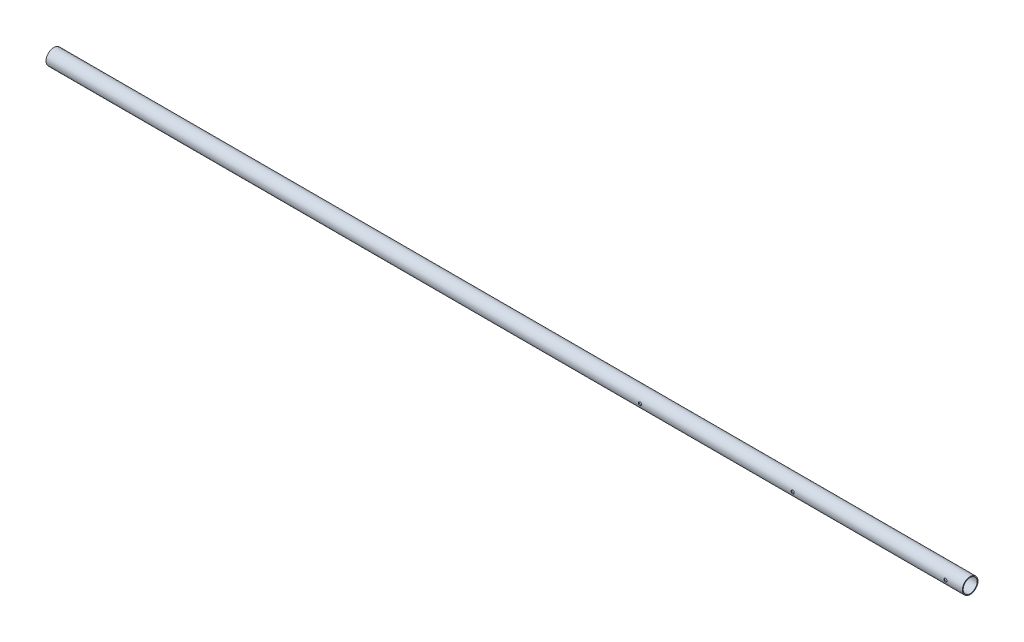
ISO-10303-21;
HEADER;
FILE_DESCRIPTION(('STEP AP214'),'2;1');
FILE_NAME('part.step','',(''),(''),'','','');
FILE_SCHEMA(('AUTOMOTIVE_DESIGN { 1 0 10303 214 1 1 1 1 }'));
ENDSEC;
DATA;
#1=APPLICATION_CONTEXT('core data for automotive mechanical design processes');
#2=APPLICATION_PROTOCOL_DEFINITION('international standard','automotive_design',2000,#1);
#3=PRODUCT_CONTEXT('',#1,'mechanical');
#4=PRODUCT('Part','Part','',(#3));
#5=PRODUCT_RELATED_PRODUCT_CATEGORY('part','',(#4));
#6=PRODUCT_DEFINITION_FORMATION('','',#4);
#7=PRODUCT_DEFINITION_CONTEXT('part definition',#1,'design');
#8=PRODUCT_DEFINITION('design','',#6,#7);
#9=PRODUCT_DEFINITION_SHAPE('','',#8);
#10=(LENGTH_UNIT() NAMED_UNIT(*) SI_UNIT(.MILLI.,.METRE.));
#11=(NAMED_UNIT(*) PLANE_ANGLE_UNIT() SI_UNIT($,.RADIAN.));
#12=(NAMED_UNIT(*) SI_UNIT($,.STERADIAN.) SOLID_ANGLE_UNIT());
#13=UNCERTAINTY_MEASURE_WITH_UNIT(LENGTH_MEASURE(1.E-05),#10,'distance_accuracy_value','');
#14=(GEOMETRIC_REPRESENTATION_CONTEXT(3) GLOBAL_UNCERTAINTY_ASSIGNED_CONTEXT((#13)) GLOBAL_UNIT_ASSIGNED_CONTEXT((#10,
#11,#12)) REPRESENTATION_CONTEXT('',''));
#15=CARTESIAN_POINT('',(0.,0.,0.));
#16=DIRECTION('',(0.,0.,1.));
#17=DIRECTION('',(1.,0.,0.));
#18=AXIS2_PLACEMENT_3D('',#15,#16,#17);
#19=CARTESIAN_POINT('',(1346.2,0.,0.));
#20=DIRECTION('',(0.,0.,1.));
#21=DIRECTION('',(1.,0.,0.));
#22=AXIS2_PLACEMENT_3D('',#19,#20,#21);
#23=CYLINDRICAL_SURFACE('',#22,2.3876);
#24=CARTESIAN_POINT('',(1343.8124,0.,10.4648));
#25=CARTESIAN_POINT('',(1343.81240657058,0.132130476058959,10.4647964514016));
#26=CARTESIAN_POINT('',(1343.82341617162,0.264420358290094,10.462269601893));
#27=CARTESIAN_POINT('',(1343.86714590616,0.525345225066872,10.4524244369325));
#28=CARTESIAN_POINT('',(1343.8999078953,0.653972663795565,10.4450968843992));
#29=CARTESIAN_POINT('',(1343.98605711521,0.903596989816604,10.426465897886));
#30=CARTESIAN_POINT('',(1344.03941180257,1.02460556826829,10.4151687397336));
#31=CARTESIAN_POINT('',(1344.1651414532,1.25591227924259,10.3898161075362));
#32=CARTESIAN_POINT('',(1344.23751087387,1.36621352003832,10.3757614375804));
#33=CARTESIAN_POINT('',(1344.40056206508,1.57495019781504,10.3461524526149));
#34=CARTESIAN_POINT('',(1344.49151335739,1.67317229092836,10.3305780670015));
#35=CARTESIAN_POINT('',(1344.68857265671,1.85311314339548,10.2998234611443));
#36=CARTESIAN_POINT('',(1344.79468293091,1.93482942970319,10.2846433002633));
#37=CARTESIAN_POINT('',(1345.02063052625,2.08038327019831,10.2561995352339));
#38=CARTESIAN_POINT('',(1345.14061845344,2.14399244864527,10.2429613530362));
#39=CARTESIAN_POINT('',(1345.38993221242,2.25005969360349,10.2201875236951));
#40=CARTESIAN_POINT('',(1345.51925674251,2.29252070204645,10.2106513616026));
#41=CARTESIAN_POINT('',(1345.7812667249,2.3543805931442,10.1965646284168));
#42=CARTESIAN_POINT('',(1345.91385876982,2.37415617862409,10.1919327227922));
#43=CARTESIAN_POINT('',(1346.18055342078,2.39125577964706,10.187934919261));
#44=CARTESIAN_POINT('',(1346.31465582384,2.38858277701799,10.1885683219677));
#45=CARTESIAN_POINT('',(1346.577738235,2.36116353389813,10.19495607049));
#46=CARTESIAN_POINT('',(1346.7067670664,2.33685826485838,10.2006081066181));
#47=CARTESIAN_POINT('',(1346.9588669272,2.26756413482412,10.2162342190724));
#48=CARTESIAN_POINT('',(1347.08193755346,2.2225738764058,10.2262085874015));
#49=CARTESIAN_POINT('',(1347.31985309298,2.11278891738554,10.2494546633016));
#50=CARTESIAN_POINT('',(1347.43461795279,2.04782683973298,10.262754053739));
#51=CARTESIAN_POINT('',(1347.65177152251,1.9000645756494,10.2911338885937));
#52=CARTESIAN_POINT('',(1347.75415927029,1.81726300387501,10.30621447129));
#53=CARTESIAN_POINT('',(1347.94617992629,1.63386805841727,10.3368922317217));
#54=CARTESIAN_POINT('',(1348.03545799324,1.53290344594706,10.352493236861));
#55=CARTESIAN_POINT('',(1348.19591330623,1.31720690355542,10.3821402814243));
#56=CARTESIAN_POINT('',(1348.26708270724,1.20246903835412,10.3961856454301));
#57=CARTESIAN_POINT('',(1348.38939723511,0.961997129098334,10.4211927318742));
#58=CARTESIAN_POINT('',(1348.44047668404,0.836228635777723,10.4321443077834));
#59=CARTESIAN_POINT('',(1348.52057759237,0.577744190266569,10.4496381198318));
#60=CARTESIAN_POINT('',(1348.54964516397,0.445043387745705,10.4561895704206));
#61=CARTESIAN_POINT('',(1348.57403794837,0.259405998113417,10.4617127845025));
#62=CARTESIAN_POINT('',(1348.57911906516,0.207669475492341,10.4628677610205));
#63=CARTESIAN_POINT('',(1348.58590138703,0.103963530060327,10.4644120677081));
#64=CARTESIAN_POINT('',(1348.58760258556,0.0519941067982693,10.464801396394));
#65=CARTESIAN_POINT('',(1348.58759342942,-0.13213047605895,10.4647964514016));
#66=CARTESIAN_POINT('',(1348.57658382838,-0.264420358290086,10.462269601893));
#67=CARTESIAN_POINT('',(1348.53285409384,-0.525345225066867,10.4524244369325));
#68=CARTESIAN_POINT('',(1348.5000921047,-0.653972663795562,10.4450968843992));
#69=CARTESIAN_POINT('',(1348.41394288479,-0.903596989816603,10.426465897886));
#70=CARTESIAN_POINT('',(1348.36058819743,-1.02460556826829,10.4151687397336));
#71=CARTESIAN_POINT('',(1348.2348585468,-1.25591227924258,10.3898161075362));
#72=CARTESIAN_POINT('',(1348.16248912613,-1.36621352003832,10.3757614375804));
#73=CARTESIAN_POINT('',(1347.99943793492,-1.57495019781504,10.3461524526149));
#74=CARTESIAN_POINT('',(1347.90848664261,-1.67317229092836,10.3305780670015));
#75=CARTESIAN_POINT('',(1347.71142734329,-1.85311314339549,10.2998234611443));
#76=CARTESIAN_POINT('',(1347.60531706909,-1.93482942970319,10.2846433002633));
#77=CARTESIAN_POINT('',(1347.37936947375,-2.08038327019831,10.2561995352339));
#78=CARTESIAN_POINT('',(1347.25938154656,-2.14399244864527,10.2429613530362));
#79=CARTESIAN_POINT('',(1347.01006778758,-2.25005969360349,10.2201875236951));
#80=CARTESIAN_POINT('',(1346.88074325748,-2.29252070204645,10.2106513616026));
#81=CARTESIAN_POINT('',(1346.6187332751,-2.3543805931442,10.1965646284168));
#82=CARTESIAN_POINT('',(1346.48614123018,-2.37415617862409,10.1919327227922));
#83=CARTESIAN_POINT('',(1346.21944657922,-2.39125577964706,10.187934919261));
#84=CARTESIAN_POINT('',(1346.08534417616,-2.38858277701799,10.1885683219677));
#85=CARTESIAN_POINT('',(1345.822261765,-2.36116353389813,10.19495607049));
#86=CARTESIAN_POINT('',(1345.6932329336,-2.33685826485837,10.2006081066181));
#87=CARTESIAN_POINT('',(1345.4411330728,-2.26756413482412,10.2162342190724));
#88=CARTESIAN_POINT('',(1345.31806244654,-2.22257387640582,10.2262085874015));
#89=CARTESIAN_POINT('',(1345.08014690702,-2.11278891738551,10.2494546633016));
#90=CARTESIAN_POINT('',(1344.96538204721,-2.04782683973289,10.262754053739));
#91=CARTESIAN_POINT('',(1344.74822847749,-1.9000645756493,10.2911338885937));
#92=CARTESIAN_POINT('',(1344.64584072971,-1.81726300387498,10.30621447129));
#93=CARTESIAN_POINT('',(1344.45382007371,-1.63386805841729,10.3368922317217));
#94=CARTESIAN_POINT('',(1344.36454200676,-1.53290344594706,10.352493236861));
#95=CARTESIAN_POINT('',(1344.20408669377,-1.31720690355541,10.3821402814243));
#96=CARTESIAN_POINT('',(1344.13291729276,-1.20246903835412,10.3961856454301));
#97=CARTESIAN_POINT('',(1344.01060276489,-0.961997129098335,10.4211927318742));
#98=CARTESIAN_POINT('',(1343.95952331596,-0.836228635777724,10.4321443077834));
#99=CARTESIAN_POINT('',(1343.87942240763,-0.577744190266569,10.4496381198318));
#100=CARTESIAN_POINT('',(1343.85035483603,-0.445043387745706,10.4561895704206));
#101=CARTESIAN_POINT('',(1343.82596205163,-0.259405998113415,10.4617127845025));
#102=CARTESIAN_POINT('',(1343.82088093484,-0.207669475492337,10.4628677610205));
#103=CARTESIAN_POINT('',(1343.81409861297,-0.10396353006032,10.4644120677081));
#104=CARTESIAN_POINT('',(1343.81239741444,-0.0519941067982609,10.464801396394));
#105=CARTESIAN_POINT('',(1343.8124,0.,10.4648));
#106=B_SPLINE_CURVE_WITH_KNOTS('',3,(#24,#25,#26,#27,#28,#29,#30,#31,#32,#33,#34,#35,#36,#37,
#38,#39,#40,#41,#42,#43,#44,#45,#46,#47,#48,#49,#50,#51,#52,#53,#54,#55,#56,#57,#58,#59,#60,#61,
#62,#63,#64,#65,#66,#67,#68,#69,#70,#71,#72,#73,#74,#75,#76,#77,#78,#79,#80,#81,#82,#83,#84,#85,
#86,#87,#88,#89,#90,#91,#92,#93,#94,#95,#96,#97,#98,#99,#100,#101,#102,#103,#104,#105),
.UNSPECIFIED.,.T.,.F.,(4,2,2,2,2,2,2,2,2,2,2,2,2,2,2,2,2,2,2,2,2,2,2,2,2,2,2,2,2,2,2,2,2,2,2,2,
2,2,2,2,4),(0.,0.396192335565521,0.79314923653144,1.18948136344149,1.58569809138061,
1.98813187019893,2.39062590055583,2.79799171002007,3.20530083479919,3.60574375712304,
4.00613348977789,4.39854363394344,4.79098029220885,5.18679987270528,5.58265020204462,
5.98777052529931,6.39306605720461,6.79967577915924,7.20543132878516,7.3613350029747,
7.51723897927502,7.91343131484055,8.31038821580647,8.70672034271652,9.10293707065564,
9.50537084947396,9.90786487983086,10.3152306892951,10.7225398140742,11.1229827363981,
11.5233724690529,11.9157826132185,12.3082192714839,12.7040388519804,13.0998891813196,
13.5050095045743,13.9103050364796,14.3169147584343,14.7226703080602,14.8785739822497,
15.0344779585501),.UNSPECIFIED.);
#107=CARTESIAN_POINT('',(1343.8124,0.,10.4648));
#108=VERTEX_POINT('',#107);
#109=EDGE_CURVE('E19',#108,#108,#106,.T.);
#110=ORIENTED_EDGE('',*,*,#109,.T.);
#111=EDGE_LOOP('',(#110));
#112=FACE_BOUND('',#111,.T.);
#113=CARTESIAN_POINT('',(1348.5876,0.,11.7094));
#114=CARTESIAN_POINT('',(1348.58759361251,-0.132501086344402,11.7093968551788));
#115=CARTESIAN_POINT('',(1348.57652258358,-0.265166024845111,11.7071257374413));
#116=CARTESIAN_POINT('',(1348.53253746572,-0.526849554492234,11.6982775922243));
#117=CARTESIAN_POINT('',(1348.49958029351,-0.655860429224834,11.6916920721091));
#118=CARTESIAN_POINT('',(1348.41288359507,-0.906255046388054,11.6749505775353));
#119=CARTESIAN_POINT('',(1348.35917393174,-1.02764945848309,11.6647997354875));
#120=CARTESIAN_POINT('',(1348.23257445261,-1.2596591169014,11.6420321579165));
#121=CARTESIAN_POINT('',(1348.15969088289,-1.37027785745343,11.6294162257641));
#122=CARTESIAN_POINT('',(1347.99571094239,-1.57921276418642,11.6029039480084));
#123=CARTESIAN_POINT('',(1347.90439503876,-1.6773548592244,11.5889933768196));
#124=CARTESIAN_POINT('',(1347.70661007537,-1.85704483488596,11.5615619569379));
#125=CARTESIAN_POINT('',(1347.60013899449,-1.93859049865887,11.5480411605155));
#126=CARTESIAN_POINT('',(1347.37382383085,-2.08350496871509,11.5227833227264));
#127=CARTESIAN_POINT('',(1347.25386273295,-2.14669446383445,11.5110643719314));
#128=CARTESIAN_POINT('',(1347.00474830275,-2.25195306228856,11.4909375714077));
#129=CARTESIAN_POINT('',(1346.87559599571,-2.29402451711493,11.4825293530518));
#130=CARTESIAN_POINT('',(1346.61362408514,-2.35529135266296,11.4701187577407));
#131=CARTESIAN_POINT('',(1346.48087823956,-2.37479005044551,11.466058019604));
#132=CARTESIAN_POINT('',(1346.21394179013,-2.39130019113447,11.4626265766828));
#133=CARTESIAN_POINT('',(1346.07975133926,-2.38831399216307,11.4632553800786));
#134=CARTESIAN_POINT('',(1345.81596250299,-2.36018417024732,11.4690789755403));
#135=CARTESIAN_POINT('',(1345.68632509506,-2.33538937330178,11.4742018815859));
#136=CARTESIAN_POINT('',(1345.43308852197,-2.26489687388461,11.4883232389105));
#137=CARTESIAN_POINT('',(1345.30948970136,-2.21919798021408,11.4973219110444));
#138=CARTESIAN_POINT('',(1345.07083594354,-2.10786238672539,11.5182541614116));
#139=CARTESIAN_POINT('',(1344.95584724852,-2.04208765068246,11.530207946514));
#140=CARTESIAN_POINT('',(1344.73841718292,-1.89256990409025,11.5556895535593));
#141=CARTESIAN_POINT('',(1344.63597639261,-1.80882606308652,11.5692174482375));
#142=CARTESIAN_POINT('',(1344.44454590737,-1.62390008155478,11.5966321353516));
#143=CARTESIAN_POINT('',(1344.35584078296,-1.52242344107398,11.6105209319932));
#144=CARTESIAN_POINT('',(1344.19662715763,-1.30583257466412,11.6368694878022));
#145=CARTESIAN_POINT('',(1344.12612663351,-1.19071240261345,11.6493286192029));
#146=CARTESIAN_POINT('',(1344.00527149346,-0.949748586750855,11.6714479602392));
#147=CARTESIAN_POINT('',(1343.9549666018,-0.823879389397865,11.6811012456));
#148=CARTESIAN_POINT('',(1343.87639590619,-0.565396223279503,11.6964543805325));
#149=CARTESIAN_POINT('',(1343.84808386216,-0.432797033549384,11.7021625219848));
#150=CARTESIAN_POINT('',(1343.82492514901,-0.249318904557282,11.7068515544713));
#151=CARTESIAN_POINT('',(1343.82023228487,-0.199582540492454,11.7078050643738));
#152=CARTESIAN_POINT('',(1343.81396850378,-0.0999052173920093,11.7090798805314));
#153=CARTESIAN_POINT('',(1343.81239759137,-0.0499642580588528,11.7094011858669));
#154=CARTESIAN_POINT('',(1343.81240638749,0.132501086344419,11.7093968551788));
#155=CARTESIAN_POINT('',(1343.82347741642,0.265166024845123,11.7071257374413));
#156=CARTESIAN_POINT('',(1343.86746253428,0.526849554492244,11.6982775922243));
#157=CARTESIAN_POINT('',(1343.90041970649,0.655860429224849,11.6916920721091));
#158=CARTESIAN_POINT('',(1343.98711640493,0.906255046387991,11.6749505775353));
#159=CARTESIAN_POINT('',(1344.04082606826,1.02764945848295,11.6647997354875));
#160=CARTESIAN_POINT('',(1344.16742554739,1.25965911690127,11.6420321579165));
#161=CARTESIAN_POINT('',(1344.24030911711,1.37027785745337,11.6294162257641));
#162=CARTESIAN_POINT('',(1344.40428905761,1.57921276418644,11.6029039480084));
#163=CARTESIAN_POINT('',(1344.49560496124,1.6773548592244,11.5889933768196));
#164=CARTESIAN_POINT('',(1344.69338992463,1.85704483488596,11.5615619569379));
#165=CARTESIAN_POINT('',(1344.79986100551,1.93859049865887,11.5480411605155));
#166=CARTESIAN_POINT('',(1345.02617616915,2.08350496871509,11.5227833227264));
#167=CARTESIAN_POINT('',(1345.14613726705,2.14669446383445,11.5110643719314));
#168=CARTESIAN_POINT('',(1345.39525169725,2.25195306228856,11.4909375714077));
#169=CARTESIAN_POINT('',(1345.52440400429,2.29402451711493,11.4825293530518));
#170=CARTESIAN_POINT('',(1345.78637591486,2.35529135266296,11.4701187577407));
#171=CARTESIAN_POINT('',(1345.91912176044,2.37479005044551,11.466058019604));
#172=CARTESIAN_POINT('',(1346.18605820987,2.39130019113447,11.4626265766828));
#173=CARTESIAN_POINT('',(1346.32024866074,2.38831399216307,11.4632553800786));
#174=CARTESIAN_POINT('',(1346.58403749701,2.36018417024732,11.4690789755403));
#175=CARTESIAN_POINT('',(1346.71367490494,2.33538937330178,11.4742018815859));
#176=CARTESIAN_POINT('',(1346.96691147803,2.26489687388461,11.4883232389105));
#177=CARTESIAN_POINT('',(1347.09051029864,2.21919798021408,11.4973219110444));
#178=CARTESIAN_POINT('',(1347.32916405645,2.10786238672539,11.5182541614116));
#179=CARTESIAN_POINT('',(1347.44415275148,2.04208765068246,11.530207946514));
#180=CARTESIAN_POINT('',(1347.66158281708,1.89256990409025,11.5556895535593));
#181=CARTESIAN_POINT('',(1347.76402360739,1.80882606308652,11.5692174482375));
#182=CARTESIAN_POINT('',(1347.95545409263,1.62390008155478,11.5966321353516));
#183=CARTESIAN_POINT('',(1348.04415921704,1.52242344107398,11.6105209319932));
#184=CARTESIAN_POINT('',(1348.20337284237,1.30583257466412,11.6368694878022));
#185=CARTESIAN_POINT('',(1348.27387336649,1.19071240261345,11.6493286192029));
#186=CARTESIAN_POINT('',(1348.39472850654,0.949748586750855,11.6714479602392));
#187=CARTESIAN_POINT('',(1348.4450333982,0.823879389397864,11.6811012456));
#188=CARTESIAN_POINT('',(1348.52360409381,0.565396223279503,11.6964543805325));
#189=CARTESIAN_POINT('',(1348.55191613784,0.432797033549384,11.7021625219848));
#190=CARTESIAN_POINT('',(1348.57507485099,0.249318904557285,11.7068515544713));
#191=CARTESIAN_POINT('',(1348.57976771513,0.19958254049246,11.7078050643738));
#192=CARTESIAN_POINT('',(1348.58603149622,0.0999052173920236,11.7090798805314));
#193=CARTESIAN_POINT('',(1348.58760240863,0.0499642580588708,11.7094011858669));
#194=CARTESIAN_POINT('',(1348.5876,0.,11.7094));
#195=B_SPLINE_CURVE_WITH_KNOTS('',3,(#113,#114,#115,#116,#117,#118,#119,#120,#121,#122,#123,
#124,#125,#126,#127,#128,#129,#130,#131,#132,#133,#134,#135,#136,#137,#138,#139,#140,#141,#142,
#143,#144,#145,#146,#147,#148,#149,#150,#151,#152,#153,#154,#155,#156,#157,#158,#159,#160,#161,
#162,#163,#164,#165,#166,#167,#168,#169,#170,#171,#172,#173,#174,#175,#176,#177,#178,#179,#180,
#181,#182,#183,#184,#185,#186,#187,#188,#189,#190,#191,#192,#193,#194),.UNSPECIFIED.,.T.,.F.,(4,
2,2,2,2,2,2,2,2,2,2,2,2,2,2,2,2,2,2,2,2,2,2,2,2,2,2,2,2,2,2,2,2,2,2,2,2,2,2,2,4),(0.,
0.397312200182848,0.795408844407309,1.19293474701029,1.59033131169666,1.99277446437494,
2.39527133774066,2.80157706515144,3.2078375404195,3.60857317253209,4.00926677774834,
4.40366556094126,4.79808682135194,5.19528356005152,5.59249865942441,5.99707755264028,
6.40183342228439,6.80757983006337,7.21247082756087,7.36229133822713,7.51211206685328,
7.90942426703612,8.30752091126057,8.70504681386339,9.10244337854991,9.50488653122819,
9.90738340459391,10.3136891320047,10.7199496072727,11.1206852393853,11.5213788446016,
11.9157776277945,12.3101988882052,12.7073956269048,13.1046107262777,13.5091896194935,
13.9139454891376,14.3196918969166,14.7245828944141,14.8744034050804,15.0242241337065),.UNSPECIFIED.);
#196=CARTESIAN_POINT('',(1348.5876,0.,11.7094));
#197=VERTEX_POINT('',#196);
#198=EDGE_CURVE('E58',#197,#197,#195,.T.);
#199=ORIENTED_EDGE('',*,*,#198,.F.);
#200=EDGE_LOOP('',(#199));
#201=FACE_BOUND('',#200,.T.);
#202=ADVANCED_FACE('F15',(#112,#201),#23,.F.);
#203=CARTESIAN_POINT('',(1117.6,0.,0.));
#204=DIRECTION('',(0.,0.,1.));
#205=DIRECTION('',(1.,0.,0.));
#206=AXIS2_PLACEMENT_3D('',#203,#204,#205);
#207=CYLINDRICAL_SURFACE('',#206,2.3876);
#208=CARTESIAN_POINT('',(1115.2124,0.,10.4648));
#209=CARTESIAN_POINT('',(1115.21240657058,0.132130476058959,10.4647964514016));
#210=CARTESIAN_POINT('',(1115.22341617162,0.264420358290094,10.462269601893));
#211=CARTESIAN_POINT('',(1115.26714590616,0.525345225066872,10.4524244369325));
#212=CARTESIAN_POINT('',(1115.2999078953,0.653972663795564,10.4450968843992));
#213=CARTESIAN_POINT('',(1115.38605711521,0.903596989816605,10.426465897886));
#214=CARTESIAN_POINT('',(1115.43941180257,1.0246055682683,10.4151687397336));
#215=CARTESIAN_POINT('',(1115.5651414532,1.25591227924258,10.3898161075362));
#216=CARTESIAN_POINT('',(1115.63751087387,1.36621352003831,10.3757614375804));
#217=CARTESIAN_POINT('',(1115.80056206508,1.57495019781499,10.3461524526149));
#218=CARTESIAN_POINT('',(1115.89151335739,1.67317229092829,10.3305780670015));
#219=CARTESIAN_POINT('',(1116.08857265671,1.85311314339544,10.2998234611443));
#220=CARTESIAN_POINT('',(1116.19468293091,1.93482942970318,10.2846433002633));
#221=CARTESIAN_POINT('',(1116.42063052625,2.08038327019827,10.2561995352339));
#222=CARTESIAN_POINT('',(1116.54061845344,2.14399244864519,10.2429613530362));
#223=CARTESIAN_POINT('',(1116.78993221242,2.25005969360342,10.2201875236951));
#224=CARTESIAN_POINT('',(1116.91925674251,2.29252070204643,10.2106513616026));
#225=CARTESIAN_POINT('',(1117.1812667249,2.35438059314422,10.1965646284168));
#226=CARTESIAN_POINT('',(1117.31385876982,2.37415617862409,10.1919327227922));
#227=CARTESIAN_POINT('',(1117.58055342078,2.39125577964705,10.187934919261));
#228=CARTESIAN_POINT('',(1117.71465582384,2.38858277701799,10.1885683219677));
#229=CARTESIAN_POINT('',(1117.977738235,2.36116353389813,10.19495607049));
#230=CARTESIAN_POINT('',(1118.1067670664,2.33685826485838,10.2006081066181));
#231=CARTESIAN_POINT('',(1118.3588669272,2.26756413482412,10.2162342190724));
#232=CARTESIAN_POINT('',(1118.48193755346,2.2225738764058,10.2262085874015));
#233=CARTESIAN_POINT('',(1118.71985309298,2.11278891738554,10.2494546633016));
#234=CARTESIAN_POINT('',(1118.83461795279,2.04782683973298,10.262754053739));
#235=CARTESIAN_POINT('',(1119.05177152251,1.9000645756494,10.2911338885937));
#236=CARTESIAN_POINT('',(1119.15415927029,1.81726300387501,10.30621447129));
#237=CARTESIAN_POINT('',(1119.34617992629,1.63386805841727,10.3368922317217));
#238=CARTESIAN_POINT('',(1119.43545799324,1.53290344594706,10.352493236861));
#239=CARTESIAN_POINT('',(1119.59591330623,1.31720690355542,10.3821402814243));
#240=CARTESIAN_POINT('',(1119.66708270724,1.20246903835412,10.3961856454301));
#241=CARTESIAN_POINT('',(1119.78939723511,0.961997129098334,10.4211927318742));
#242=CARTESIAN_POINT('',(1119.84047668404,0.836228635777723,10.4321443077834));
#243=CARTESIAN_POINT('',(1119.92057759237,0.577744190266569,10.4496381198318));
#244=CARTESIAN_POINT('',(1119.94964516397,0.445043387745705,10.4561895704206));
#245=CARTESIAN_POINT('',(1119.97403794837,0.259405998113417,10.4617127845025));
#246=CARTESIAN_POINT('',(1119.97911906516,0.207669475492341,10.4628677610205));
#247=CARTESIAN_POINT('',(1119.98590138703,0.103963530060327,10.4644120677081));
#248=CARTESIAN_POINT('',(1119.98760258556,0.0519941067982694,10.464801396394));
#249=CARTESIAN_POINT('',(1119.98759342942,-0.132130476058951,10.4647964514016));
#250=CARTESIAN_POINT('',(1119.97658382838,-0.264420358290087,10.462269601893));
#251=CARTESIAN_POINT('',(1119.93285409384,-0.525345225066867,10.4524244369325));
#252=CARTESIAN_POINT('',(1119.9000921047,-0.653972663795561,10.4450968843992));
#253=CARTESIAN_POINT('',(1119.81394288479,-0.903596989816604,10.426465897886));
#254=CARTESIAN_POINT('',(1119.76058819743,-1.02460556826829,10.4151687397336));
#255=CARTESIAN_POINT('',(1119.6348585468,-1.25591227924258,10.3898161075362));
#256=CARTESIAN_POINT('',(1119.56248912613,-1.36621352003831,10.3757614375804));
#257=CARTESIAN_POINT('',(1119.39943793492,-1.57495019781508,10.3461524526149));
#258=CARTESIAN_POINT('',(1119.30848664261,-1.67317229092846,10.3305780670014));
#259=CARTESIAN_POINT('',(1119.11142734329,-1.85311314339557,10.2998234611443));
#260=CARTESIAN_POINT('',(1119.00531706909,-1.93482942970322,10.2846433002633));
#261=CARTESIAN_POINT('',(1118.77936947375,-2.08038327019829,10.2561995352339));
#262=CARTESIAN_POINT('',(1118.65938154656,-2.14399244864527,10.2429613530362));
#263=CARTESIAN_POINT('',(1118.41006778758,-2.25005969360349,10.2201875236951));
#264=CARTESIAN_POINT('',(1118.28074325749,-2.29252070204645,10.2106513616026));
#265=CARTESIAN_POINT('',(1118.0187332751,-2.3543805931442,10.1965646284168));
#266=CARTESIAN_POINT('',(1117.88614123018,-2.37415617862409,10.1919327227922));
#267=CARTESIAN_POINT('',(1117.61944657922,-2.39125577964706,10.187934919261));
#268=CARTESIAN_POINT('',(1117.48534417616,-2.38858277701799,10.1885683219677));
#269=CARTESIAN_POINT('',(1117.222261765,-2.36116353389813,10.19495607049));
#270=CARTESIAN_POINT('',(1117.0932329336,-2.33685826485838,10.2006081066181));
#271=CARTESIAN_POINT('',(1116.8411330728,-2.26756413482412,10.2162342190724));
#272=CARTESIAN_POINT('',(1116.71806244654,-2.2225738764058,10.2262085874015));
#273=CARTESIAN_POINT('',(1116.48014690702,-2.11278891738554,10.2494546633016));
#274=CARTESIAN_POINT('',(1116.36538204721,-2.04782683973297,10.262754053739));
#275=CARTESIAN_POINT('',(1116.14822847749,-1.9000645756494,10.2911338885937));
#276=CARTESIAN_POINT('',(1116.04584072971,-1.81726300387503,10.30621447129));
#277=CARTESIAN_POINT('',(1115.85382007371,-1.6338680584173,10.3368922317217));
#278=CARTESIAN_POINT('',(1115.76454200676,-1.5329034459471,10.352493236861));
#279=CARTESIAN_POINT('',(1115.60408669377,-1.31720690355547,10.3821402814243));
#280=CARTESIAN_POINT('',(1115.53291729276,-1.20246903835416,10.3961856454301));
#281=CARTESIAN_POINT('',(1115.41060276489,-0.961997129098351,10.4211927318742));
#282=CARTESIAN_POINT('',(1115.35952331596,-0.836228635777728,10.4321443077834));
#283=CARTESIAN_POINT('',(1115.27942240763,-0.577744190266565,10.4496381198318));
#284=CARTESIAN_POINT('',(1115.25035483603,-0.445043387745705,10.4561895704206));
#285=CARTESIAN_POINT('',(1115.22596205163,-0.259405998113415,10.4617127845025));
#286=CARTESIAN_POINT('',(1115.22088093484,-0.207669475492337,10.4628677610205));
#287=CARTESIAN_POINT('',(1115.21409861297,-0.10396353006032,10.4644120677081));
#288=CARTESIAN_POINT('',(1115.21239741444,-0.0519941067982609,10.464801396394));
#289=CARTESIAN_POINT('',(1115.2124,0.,10.4648));
#290=B_SPLINE_CURVE_WITH_KNOTS('',3,(#208,#209,#210,#211,#212,#213,#214,#215,#216,#217,#218,
#219,#220,#221,#222,#223,#224,#225,#226,#227,#228,#229,#230,#231,#232,#233,#234,#235,#236,#237,
#238,#239,#240,#241,#242,#243,#244,#245,#246,#247,#248,#249,#250,#251,#252,#253,#254,#255,#256,
#257,#258,#259,#260,#261,#262,#263,#264,#265,#266,#267,#268,#269,#270,#271,#272,#273,#274,#275,
#276,#277,#278,#279,#280,#281,#282,#283,#284,#285,#286,#287,#288,#289),.UNSPECIFIED.,.T.,.F.,(4,
2,2,2,2,2,2,2,2,2,2,2,2,2,2,2,2,2,2,2,2,2,2,2,2,2,2,2,2,2,2,2,2,2,2,2,2,2,2,2,4),(0.,
0.396192335565521,0.79314923653144,1.18948136344149,1.58569809138061,1.9881318701987,
2.39062590055584,2.79799171002005,3.20530083479919,3.60574375712304,4.00613348977788,
4.39854363394344,4.79098029220885,5.18679987270528,5.58265020204462,5.98777052529931,
6.39306605720461,6.79967577915923,7.20543132878515,7.3613350029747,7.51723897927502,
7.91343131484055,8.31038821580647,8.70672034271652,9.10293707065564,9.50537084947404,
9.90786487983087,10.3152306892951,10.7225398140742,11.1229827363981,11.5233724690529,
11.9157826132185,12.3082192714839,12.7040388519803,13.0998891813197,13.5050095045741,
13.9103050364796,14.3169147584343,14.7226703080602,14.8785739822497,15.0344779585501),.UNSPECIFIED.);
#291=CARTESIAN_POINT('',(1115.2124,0.,10.4648));
#292=VERTEX_POINT('',#291);
#293=EDGE_CURVE('E70',#292,#292,#290,.T.);
#294=ORIENTED_EDGE('',*,*,#293,.T.);
#295=EDGE_LOOP('',(#294));
#296=FACE_BOUND('',#295,.T.);
#297=CARTESIAN_POINT('',(1119.9876,0.,11.7094));
#298=CARTESIAN_POINT('',(1119.98759361251,-0.1325010863444,11.7093968551788));
#299=CARTESIAN_POINT('',(1119.97652258358,-0.265166024845106,11.7071257374413));
#300=CARTESIAN_POINT('',(1119.93253746572,-0.526849554492239,11.6982775922243));
#301=CARTESIAN_POINT('',(1119.89958029351,-0.655860429224853,11.6916920721091));
#302=CARTESIAN_POINT('',(1119.81288359507,-0.90625504638809,11.6749505775353));
#303=CARTESIAN_POINT('',(1119.75917393174,-1.02764945848313,11.6647997354875));
#304=CARTESIAN_POINT('',(1119.63257445261,-1.25965911690144,11.6420321579165));
#305=CARTESIAN_POINT('',(1119.55969088289,-1.37027785745347,11.6294162257641));
#306=CARTESIAN_POINT('',(1119.39571094239,-1.57921276418641,11.6029039480084));
#307=CARTESIAN_POINT('',(1119.30439503876,-1.6773548592243,11.5889933768196));
#308=CARTESIAN_POINT('',(1119.10661007537,-1.85704483488587,11.5615619569379));
#309=CARTESIAN_POINT('',(1119.00013899449,-1.93859049865884,11.5480411605155));
#310=CARTESIAN_POINT('',(1118.77382383085,-2.08350496871515,11.5227833227264));
#311=CARTESIAN_POINT('',(1118.65386273295,-2.14669446383452,11.5110643719314));
#312=CARTESIAN_POINT('',(1118.40474830275,-2.25195306228859,11.4909375714077));
#313=CARTESIAN_POINT('',(1118.27559599571,-2.29402451711494,11.4825293530518));
#314=CARTESIAN_POINT('',(1118.01362408514,-2.35529135266295,11.4701187577407));
#315=CARTESIAN_POINT('',(1117.88087823956,-2.37479005044549,11.4660580196041));
#316=CARTESIAN_POINT('',(1117.61394179013,-2.39130019113447,11.4626265766828));
#317=CARTESIAN_POINT('',(1117.47975133926,-2.38831399216308,11.4632553800786));
#318=CARTESIAN_POINT('',(1117.21596250299,-2.36018417024732,11.4690789755403));
#319=CARTESIAN_POINT('',(1117.08632509506,-2.33538937330178,11.4742018815859));
#320=CARTESIAN_POINT('',(1116.83308852197,-2.26489687388461,11.4883232389105));
#321=CARTESIAN_POINT('',(1116.70948970136,-2.21919798021407,11.4973219110444));
#322=CARTESIAN_POINT('',(1116.47083594354,-2.10786238672539,11.5182541614116));
#323=CARTESIAN_POINT('',(1116.35584724852,-2.04208765068247,11.530207946514));
#324=CARTESIAN_POINT('',(1116.13841718292,-1.89256990409024,11.5556895535593));
#325=CARTESIAN_POINT('',(1116.03597639261,-1.80882606308651,11.5692174482375));
#326=CARTESIAN_POINT('',(1115.84454590737,-1.62390008155481,11.5966321353515));
#327=CARTESIAN_POINT('',(1115.75584078296,-1.52242344107406,11.6105209319932));
#328=CARTESIAN_POINT('',(1115.59662715763,-1.30583257466421,11.6368694878022));
#329=CARTESIAN_POINT('',(1115.52612663351,-1.19071240261349,11.6493286192029));
#330=CARTESIAN_POINT('',(1115.40527149346,-0.949748586750846,11.6714479602392));
#331=CARTESIAN_POINT('',(1115.3549666018,-0.823879389397862,11.6811012456));
#332=CARTESIAN_POINT('',(1115.27639590619,-0.565396223279506,11.6964543805325));
#333=CARTESIAN_POINT('',(1115.24808386216,-0.432797033549384,11.7021625219848));
#334=CARTESIAN_POINT('',(1115.22492514901,-0.249318904557282,11.7068515544713));
#335=CARTESIAN_POINT('',(1115.22023228487,-0.199582540492454,11.7078050643738));
#336=CARTESIAN_POINT('',(1115.21396850378,-0.0999052173920094,11.7090798805314));
#337=CARTESIAN_POINT('',(1115.21239759137,-0.0499642580588528,11.7094011858669));
#338=CARTESIAN_POINT('',(1115.21240638749,0.132501086344419,11.7093968551788));
#339=CARTESIAN_POINT('',(1115.22347741642,0.265166024845124,11.7071257374413));
#340=CARTESIAN_POINT('',(1115.26746253428,0.526849554492243,11.6982775922243));
#341=CARTESIAN_POINT('',(1115.30041970649,0.655860429224845,11.6916920721091));
#342=CARTESIAN_POINT('',(1115.38711640493,0.906255046388022,11.6749505775353));
#343=CARTESIAN_POINT('',(1115.44082606826,1.02764945848302,11.6647997354875));
#344=CARTESIAN_POINT('',(1115.56742554739,1.25965911690134,11.6420321579165));
#345=CARTESIAN_POINT('',(1115.64030911711,1.37027785745342,11.6294162257641));
#346=CARTESIAN_POINT('',(1115.80428905761,1.57921276418639,11.6029039480084));
#347=CARTESIAN_POINT('',(1115.89560496124,1.6773548592243,11.5889933768196));
#348=CARTESIAN_POINT('',(1116.09338992463,1.85704483488587,11.5615619569379));
#349=CARTESIAN_POINT('',(1116.19986100551,1.93859049865884,11.5480411605155));
#350=CARTESIAN_POINT('',(1116.42617616915,2.08350496871515,11.5227833227264));
#351=CARTESIAN_POINT('',(1116.54613726705,2.14669446383452,11.5110643719314));
#352=CARTESIAN_POINT('',(1116.79525169725,2.25195306228859,11.4909375714077));
#353=CARTESIAN_POINT('',(1116.92440400429,2.29402451711494,11.4825293530518));
#354=CARTESIAN_POINT('',(1117.18637591486,2.35529135266296,11.4701187577407));
#355=CARTESIAN_POINT('',(1117.31912176044,2.37479005044551,11.466058019604));
#356=CARTESIAN_POINT('',(1117.58605820987,2.39130019113447,11.4626265766828));
#357=CARTESIAN_POINT('',(1117.72024866074,2.38831399216307,11.4632553800786));
#358=CARTESIAN_POINT('',(1117.98403749701,2.36018417024732,11.4690789755403));
#359=CARTESIAN_POINT('',(1118.11367490494,2.33538937330178,11.4742018815859));
#360=CARTESIAN_POINT('',(1118.36691147803,2.26489687388461,11.4883232389105));
#361=CARTESIAN_POINT('',(1118.49051029864,2.21919798021407,11.4973219110444));
#362=CARTESIAN_POINT('',(1118.72916405645,2.10786238672539,11.5182541614116));
#363=CARTESIAN_POINT('',(1118.84415275148,2.04208765068247,11.530207946514));
#364=CARTESIAN_POINT('',(1119.06158281708,1.89256990409024,11.5556895535593));
#365=CARTESIAN_POINT('',(1119.16402360739,1.80882606308651,11.5692174482375));
#366=CARTESIAN_POINT('',(1119.35545409263,1.62390008155481,11.5966321353515));
#367=CARTESIAN_POINT('',(1119.44415921704,1.52242344107405,11.6105209319932));
#368=CARTESIAN_POINT('',(1119.60337284237,1.30583257466421,11.6368694878022));
#369=CARTESIAN_POINT('',(1119.67387336649,1.19071240261351,11.6493286192029));
#370=CARTESIAN_POINT('',(1119.79472850654,0.94974858675087,11.6714479602392));
#371=CARTESIAN_POINT('',(1119.8450333982,0.823879389397882,11.6811012456));
#372=CARTESIAN_POINT('',(1119.92360409381,0.56539622327953,11.6964543805325));
#373=CARTESIAN_POINT('',(1119.95191613784,0.432797033549412,11.7021625219848));
#374=CARTESIAN_POINT('',(1119.97507485099,0.249318904557288,11.7068515544713));
#375=CARTESIAN_POINT('',(1119.97976771513,0.199582540492461,11.7078050643738));
#376=CARTESIAN_POINT('',(1119.98603149622,0.0999052173920229,11.7090798805314));
#377=CARTESIAN_POINT('',(1119.98760240863,0.0499642580588703,11.7094011858669));
#378=CARTESIAN_POINT('',(1119.9876,0.,11.7094));
#379=B_SPLINE_CURVE_WITH_KNOTS('',3,(#297,#298,#299,#300,#301,#302,#303,#304,#305,#306,#307,
#308,#309,#310,#311,#312,#313,#314,#315,#316,#317,#318,#319,#320,#321,#322,#323,#324,#325,#326,
#327,#328,#329,#330,#331,#332,#333,#334,#335,#336,#337,#338,#339,#340,#341,#342,#343,#344,#345,
#346,#347,#348,#349,#350,#351,#352,#353,#354,#355,#356,#357,#358,#359,#360,#361,#362,#363,#364,
#365,#366,#367,#368,#369,#370,#371,#372,#373,#374,#375,#376,#377,#378),.UNSPECIFIED.,.T.,.F.,(4,
2,2,2,2,2,2,2,2,2,2,2,2,2,2,2,2,2,2,2,2,2,2,2,2,2,2,2,2,2,2,2,2,2,2,2,2,2,2,2,4),(0.,
0.397312200182848,0.795408844407309,1.19293474701047,1.59033131169663,1.99277446437483,
2.39527133774062,2.80157706515164,3.20783754041946,3.60857317253183,4.0092667777483,
4.40366556094122,4.7980868213519,5.19528356005148,5.59249865942437,5.99707755264016,
6.40183342228436,6.80757983006334,7.21247082756084,7.3622913382271,7.51211206685325,
7.90942426703609,8.30752091126054,8.70504681386344,9.10244337854988,9.50488653122808,
9.90738340459387,10.3136891320049,10.7199496072727,11.1206852393853,11.5213788446016,
11.9157776277945,12.3101988882052,12.7073956269047,13.1046107262776,13.5091896194934,
13.9139454891376,14.3196918969165,14.7245828944141,14.8744034050803,15.0242241337065),.UNSPECIFIED.);
#380=CARTESIAN_POINT('',(1119.9876,0.,11.7094));
#381=VERTEX_POINT('',#380);
#382=EDGE_CURVE('E43',#381,#381,#379,.T.);
#383=ORIENTED_EDGE('',*,*,#382,.F.);
#384=EDGE_LOOP('',(#383));
#385=FACE_BOUND('',#384,.T.);
#386=ADVANCED_FACE('F99',(#296,#385),#207,.F.);
#387=CARTESIAN_POINT('',(889.,0.,0.));
#388=DIRECTION('',(0.,0.,1.));
#389=DIRECTION('',(1.,0.,0.));
#390=AXIS2_PLACEMENT_3D('',#387,#388,#389);
#391=CYLINDRICAL_SURFACE('',#390,2.3876);
#392=CARTESIAN_POINT('',(886.6124,0.,10.4648));
#393=CARTESIAN_POINT('',(886.612406570584,0.132130476058941,10.4647964514016));
#394=CARTESIAN_POINT('',(886.623416171616,0.264420358290049,10.462269601893));
#395=CARTESIAN_POINT('',(886.667145906161,0.525345225066825,10.4524244369325));
#396=CARTESIAN_POINT('',(886.699907895298,0.653972663795544,10.4450968843992));
#397=CARTESIAN_POINT('',(886.786057115207,0.903596989816565,10.426465897886));
#398=CARTESIAN_POINT('',(886.839411802567,1.02460556826821,10.4151687397336));
#399=CARTESIAN_POINT('',(886.965141453202,1.25591227924248,10.3898161075362));
#400=CARTESIAN_POINT('',(887.037510873869,1.36621352003824,10.3757614375804));
#401=CARTESIAN_POINT('',(887.200562065082,1.57495019781497,10.3461524526149));
#402=CARTESIAN_POINT('',(887.291513357391,1.67317229092829,10.3305780670015));
#403=CARTESIAN_POINT('',(887.488572656708,1.85311314339543,10.2998234611443));
#404=CARTESIAN_POINT('',(887.59468293091,1.93482942970316,10.2846433002633));
#405=CARTESIAN_POINT('',(887.820630526246,2.08038327019829,10.2561995352339));
#406=CARTESIAN_POINT('',(887.940618453438,2.14399244864526,10.2429613530362));
#407=CARTESIAN_POINT('',(888.189932212416,2.25005969360345,10.2201875236951));
#408=CARTESIAN_POINT('',(888.319256742515,2.29252070204642,10.2106513616026));
#409=CARTESIAN_POINT('',(888.581266724905,2.35438059314418,10.1965646284168));
#410=CARTESIAN_POINT('',(888.713858769822,2.37415617862407,10.1919327227922));
#411=CARTESIAN_POINT('',(888.98055342078,2.39125577964706,10.187934919261));
#412=CARTESIAN_POINT('',(889.114655823837,2.38858277701801,10.1885683219677));
#413=CARTESIAN_POINT('',(889.377738234995,2.36116353389816,10.19495607049));
#414=CARTESIAN_POINT('',(889.506767066396,2.3368582648584,10.2006081066181));
#415=CARTESIAN_POINT('',(889.758866927197,2.26756413482414,10.2162342190724));
#416=CARTESIAN_POINT('',(889.881937553456,2.22257387640584,10.2262085874015));
#417=CARTESIAN_POINT('',(890.11985309298,2.11278891738561,10.2494546633016));
#418=CARTESIAN_POINT('',(890.234617952792,2.04782683973306,10.262754053739));
#419=CARTESIAN_POINT('',(890.451771522509,1.90006457564951,10.2911338885936));
#420=CARTESIAN_POINT('',(890.554159270293,1.81726300387515,10.30621447129));
#421=CARTESIAN_POINT('',(890.746179926289,1.63386805841741,10.3368922317217));
#422=CARTESIAN_POINT('',(890.835457993239,1.53290344594718,10.352493236861));
#423=CARTESIAN_POINT('',(890.995913306233,1.31720690355552,10.3821402814243));
#424=CARTESIAN_POINT('',(891.067082707236,1.20246903835422,10.3961856454301));
#425=CARTESIAN_POINT('',(891.18939723511,0.961997129098421,10.4211927318742));
#426=CARTESIAN_POINT('',(891.240476684035,0.836228635777814,10.4321443077834));
#427=CARTESIAN_POINT('',(891.320577592368,0.57774419026668,10.4496381198318));
#428=CARTESIAN_POINT('',(891.349645163974,0.445043387745834,10.4561895704206));
#429=CARTESIAN_POINT('',(891.374037948375,0.259405998113554,10.4617127845025));
#430=CARTESIAN_POINT('',(891.379119065164,0.207669475492453,10.4628677610205));
#431=CARTESIAN_POINT('',(891.385901387033,0.103963530060383,10.4644120677081));
#432=CARTESIAN_POINT('',(891.387602585563,0.0519941067982919,10.464801396394));
#433=CARTESIAN_POINT('',(891.387593429416,-0.13213047605894,10.4647964514016));
#434=CARTESIAN_POINT('',(891.376583828384,-0.264420358290048,10.462269601893));
#435=CARTESIAN_POINT('',(891.332854093839,-0.525345225066824,10.4524244369325));
#436=CARTESIAN_POINT('',(891.300092104702,-0.653972663795542,10.4450968843992));
#437=CARTESIAN_POINT('',(891.213942884793,-0.903596989816564,10.426465897886));
#438=CARTESIAN_POINT('',(891.160588197433,-1.02460556826821,10.4151687397336));
#439=CARTESIAN_POINT('',(891.034858546798,-1.25591227924248,10.3898161075362));
#440=CARTESIAN_POINT('',(890.96248912613,-1.36621352003823,10.3757614375804));
#441=CARTESIAN_POINT('',(890.799437934918,-1.57495019781495,10.3461524526149));
#442=CARTESIAN_POINT('',(890.708486642609,-1.67317229092825,10.3305780670015));
#443=CARTESIAN_POINT('',(890.511427343292,-1.85311314339541,10.2998234611443));
#444=CARTESIAN_POINT('',(890.40531706909,-1.93482942970314,10.2846433002633));
#445=CARTESIAN_POINT('',(890.179369473754,-2.08038327019829,10.2561995352339));
#446=CARTESIAN_POINT('',(890.059381546562,-2.14399244864525,10.2429613530362));
#447=CARTESIAN_POINT('',(889.810067787584,-2.25005969360345,10.2201875236951));
#448=CARTESIAN_POINT('',(889.680743257485,-2.29252070204642,10.2106513616026));
#449=CARTESIAN_POINT('',(889.418733275096,-2.35438059314418,10.1965646284168));
#450=CARTESIAN_POINT('',(889.286141230178,-2.37415617862407,10.1919327227922));
#451=CARTESIAN_POINT('',(889.01944657922,-2.39125577964706,10.187934919261));
#452=CARTESIAN_POINT('',(888.885344176163,-2.38858277701801,10.1885683219677));
#453=CARTESIAN_POINT('',(888.622261765005,-2.36116353389816,10.19495607049));
#454=CARTESIAN_POINT('',(888.493232933604,-2.3368582648584,10.2006081066181));
#455=CARTESIAN_POINT('',(888.241133072803,-2.26756413482414,10.2162342190724));
#456=CARTESIAN_POINT('',(888.118062446544,-2.22257387640584,10.2262085874015));
#457=CARTESIAN_POINT('',(887.88014690702,-2.1127889173856,10.2494546633016));
#458=CARTESIAN_POINT('',(887.765382047208,-2.04782683973303,10.262754053739));
#459=CARTESIAN_POINT('',(887.548228477491,-1.90006457564948,10.2911338885936));
#460=CARTESIAN_POINT('',(887.445840729707,-1.81726300387512,10.30621447129));
#461=CARTESIAN_POINT('',(887.253820073711,-1.6338680584174,10.3368922317217));
#462=CARTESIAN_POINT('',(887.164542006761,-1.53290344594718,10.352493236861));
#463=CARTESIAN_POINT('',(887.004086693767,-1.31720690355552,10.3821402814243));
#464=CARTESIAN_POINT('',(886.932917292764,-1.20246903835422,10.3961856454301));
#465=CARTESIAN_POINT('',(886.81060276489,-0.961997129098421,10.4211927318742));
#466=CARTESIAN_POINT('',(886.759523315965,-0.836228635777814,10.4321443077834));
#467=CARTESIAN_POINT('',(886.679422407632,-0.57774419026668,10.4496381198318));
#468=CARTESIAN_POINT('',(886.650354836026,-0.445043387745834,10.4561895704206));
#469=CARTESIAN_POINT('',(886.625962051625,-0.259405998113552,10.4617127845025));
#470=CARTESIAN_POINT('',(886.620880934836,-0.207669475492448,10.4628677610205));
#471=CARTESIAN_POINT('',(886.614098612967,-0.103963530060377,10.4644120677081));
#472=CARTESIAN_POINT('',(886.612397414437,-0.0519941067982883,10.464801396394));
#473=CARTESIAN_POINT('',(886.6124,0.,10.4648));
#474=B_SPLINE_CURVE_WITH_KNOTS('',3,(#392,#393,#394,#395,#396,#397,#398,#399,#400,#401,#402,
#403,#404,#405,#406,#407,#408,#409,#410,#411,#412,#413,#414,#415,#416,#417,#418,#419,#420,#421,
#422,#423,#424,#425,#426,#427,#428,#429,#430,#431,#432,#433,#434,#435,#436,#437,#438,#439,#440,
#441,#442,#443,#444,#445,#446,#447,#448,#449,#450,#451,#452,#453,#454,#455,#456,#457,#458,#459,
#460,#461,#462,#463,#464,#465,#466,#467,#468,#469,#470,#471,#472,#473),.UNSPECIFIED.,.T.,.F.,(4,
2,2,2,2,2,2,2,2,2,2,2,2,2,2,2,2,2,2,2,2,2,2,2,2,2,2,2,2,2,2,2,2,2,2,2,2,2,2,2,4),(0.,
0.396192335565467,0.793149236531383,1.18948136344143,1.58569809138048,1.98813187019881,
2.39062590055583,2.79799171002018,3.20530083479908,3.60574375712271,4.00613348977767,
4.39854363394345,4.79098029220874,5.18679987270493,5.58265020204436,5.98777052529913,
6.3930660572046,6.79967577915914,7.20543132878498,7.36133500297462,7.51723897927503,
7.9134313148405,8.31038821580641,8.70672034271646,9.10293707065551,9.50537084947372,
9.90786487983087,10.3152306892952,10.7225398140741,11.1229827363977,11.5233724690527,
11.9157826132185,12.3082192714838,12.7040388519801,13.0998891813194,13.5050095045742,
13.9103050364796,14.3169147584342,14.72267030806,14.8785739822497,15.0344779585501),.UNSPECIFIED.);
#475=CARTESIAN_POINT('',(886.6124,0.,10.4648));
#476=VERTEX_POINT('',#475);
#477=EDGE_CURVE('E66',#476,#476,#474,.T.);
#478=ORIENTED_EDGE('',*,*,#477,.T.);
#479=EDGE_LOOP('',(#478));
#480=FACE_BOUND('',#479,.T.);
#481=CARTESIAN_POINT('',(891.3876,0.,11.7094));
#482=CARTESIAN_POINT('',(891.387593612505,-0.132501086344391,11.7093968551788));
#483=CARTESIAN_POINT('',(891.376522583577,-0.265166024845089,11.7071257374413));
#484=CARTESIAN_POINT('',(891.332537465718,-0.526849554492207,11.6982775922243));
#485=CARTESIAN_POINT('',(891.299580293511,-0.655860429224814,11.6916920721091));
#486=CARTESIAN_POINT('',(891.21288359507,-0.906255046388023,11.6749505775353));
#487=CARTESIAN_POINT('',(891.159173931739,-1.02764945848304,11.6647997354875));
#488=CARTESIAN_POINT('',(891.032574452606,-1.25965911690137,11.6420321579165));
#489=CARTESIAN_POINT('',(890.959690882888,-1.37027785745343,11.6294162257641));
#490=CARTESIAN_POINT('',(890.795710942386,-1.57921276418642,11.6029039480084));
#491=CARTESIAN_POINT('',(890.704395038762,-1.67735485922435,11.5889933768196));
#492=CARTESIAN_POINT('',(890.50661007537,-1.85704483488586,11.5615619569379));
#493=CARTESIAN_POINT('',(890.400138994489,-1.93859049865876,11.5480411605156));
#494=CARTESIAN_POINT('',(890.173823830852,-2.08350496871505,11.5227833227264));
#495=CARTESIAN_POINT('',(890.053862732954,-2.14669446383447,11.5110643719314));
#496=CARTESIAN_POINT('',(889.804748302746,-2.2519530622886,11.4909375714077));
#497=CARTESIAN_POINT('',(889.675595995706,-2.29402451711494,11.4825293530518));
#498=CARTESIAN_POINT('',(889.413624085136,-2.35529135266294,11.4701187577407));
#499=CARTESIAN_POINT('',(889.28087823956,-2.3747900504455,11.4660580196041));
#500=CARTESIAN_POINT('',(889.013941790135,-2.39130019113448,11.4626265766828));
#501=CARTESIAN_POINT('',(888.879751339264,-2.38831399216307,11.4632553800786));
#502=CARTESIAN_POINT('',(888.615962502988,-2.3601841702473,11.4690789755403));
#503=CARTESIAN_POINT('',(888.486325095059,-2.33538937330177,11.4742018815859));
#504=CARTESIAN_POINT('',(888.233088521969,-2.26489687388462,11.4883232389105));
#505=CARTESIAN_POINT('',(888.109489701357,-2.2191979802141,11.4973219110444));
#506=CARTESIAN_POINT('',(887.870835943545,-2.10786238672544,11.5182541614116));
#507=CARTESIAN_POINT('',(887.755847248517,-2.04208765068252,11.530207946514));
#508=CARTESIAN_POINT('',(887.538417182923,-1.89256990409029,11.5556895535593));
#509=CARTESIAN_POINT('',(887.43597639261,-1.80882606308657,11.5692174482375));
#510=CARTESIAN_POINT('',(887.244545907369,-1.6239000815549,11.5966321353515));
#511=CARTESIAN_POINT('',(887.155840782956,-1.52242344107415,11.6105209319932));
#512=CARTESIAN_POINT('',(886.99662715763,-1.3058325746643,11.6368694878022));
#513=CARTESIAN_POINT('',(886.926126633507,-1.19071240261358,11.6493286192029));
#514=CARTESIAN_POINT('',(886.805271493458,-0.949748586750957,11.6714479602391));
#515=CARTESIAN_POINT('',(886.7549666018,-0.823879389397993,11.6811012456));
#516=CARTESIAN_POINT('',(886.676395906186,-0.565396223279638,11.6964543805325));
#517=CARTESIAN_POINT('',(886.648083862159,-0.432797033549497,11.7021625219848));
#518=CARTESIAN_POINT('',(886.624925149008,-0.249318904557356,11.7068515544713));
#519=CARTESIAN_POINT('',(886.620232284872,-0.199582540492516,11.7078050643738));
#520=CARTESIAN_POINT('',(886.613968503781,-0.0999052173920489,11.7090798805314));
#521=CARTESIAN_POINT('',(886.612397591367,-0.0499642580588809,11.7094011858669));
#522=CARTESIAN_POINT('',(886.612406387495,0.132501086344395,11.7093968551788));
#523=CARTESIAN_POINT('',(886.623477416424,0.265166024845092,11.7071257374413));
#524=CARTESIAN_POINT('',(886.667462534282,0.526849554492209,11.6982775922243));
#525=CARTESIAN_POINT('',(886.700419706489,0.655860429224816,11.6916920721091));
#526=CARTESIAN_POINT('',(886.78711640493,0.906255046388024,11.6749505775353));
#527=CARTESIAN_POINT('',(886.840826068261,1.02764945848305,11.6647997354875));
#528=CARTESIAN_POINT('',(886.967425547394,1.25965911690137,11.6420321579165));
#529=CARTESIAN_POINT('',(887.040309117112,1.37027785745342,11.6294162257641));
#530=CARTESIAN_POINT('',(887.204289057614,1.57921276418644,11.6029039480084));
#531=CARTESIAN_POINT('',(887.295604961238,1.67735485922439,11.5889933768196));
#532=CARTESIAN_POINT('',(887.49338992463,1.85704483488591,11.5615619569379));
#533=CARTESIAN_POINT('',(887.599861005511,1.93859049865877,11.5480411605156));
#534=CARTESIAN_POINT('',(887.826176169148,2.08350496871504,11.5227833227264));
#535=CARTESIAN_POINT('',(887.946137267046,2.14669446383446,11.5110643719314));
#536=CARTESIAN_POINT('',(888.195251697254,2.2519530622886,11.4909375714077));
#537=CARTESIAN_POINT('',(888.324404004294,2.29402451711494,11.4825293530518));
#538=CARTESIAN_POINT('',(888.586375914864,2.35529135266294,11.4701187577407));
#539=CARTESIAN_POINT('',(888.71912176044,2.3747900504455,11.4660580196041));
#540=CARTESIAN_POINT('',(888.986058209865,2.39130019113448,11.4626265766828));
#541=CARTESIAN_POINT('',(889.120248660736,2.38831399216307,11.4632553800786));
#542=CARTESIAN_POINT('',(889.384037497012,2.3601841702473,11.4690789755403));
#543=CARTESIAN_POINT('',(889.513674904941,2.33538937330177,11.4742018815859));
#544=CARTESIAN_POINT('',(889.766911478031,2.26489687388461,11.4883232389105));
#545=CARTESIAN_POINT('',(889.890510298643,2.21919798021407,11.4973219110444));
#546=CARTESIAN_POINT('',(890.129164056455,2.1078623867254,11.5182541614116));
#547=CARTESIAN_POINT('',(890.244152751483,2.04208765068248,11.530207946514));
#548=CARTESIAN_POINT('',(890.461582817077,1.89256990409028,11.5556895535593));
#549=CARTESIAN_POINT('',(890.56402360739,1.80882606308658,11.5692174482375));
#550=CARTESIAN_POINT('',(890.755454092631,1.62390008155487,11.5966321353515));
#551=CARTESIAN_POINT('',(890.844159217044,1.52242344107407,11.6105209319932));
#552=CARTESIAN_POINT('',(891.00337284237,1.30583257466421,11.6368694878022));
#553=CARTESIAN_POINT('',(891.073873366493,1.19071240261354,11.6493286192029));
#554=CARTESIAN_POINT('',(891.194728506542,0.949748586750956,11.6714479602391));
#555=CARTESIAN_POINT('',(891.2450333982,0.823879389397972,11.6811012456));
#556=CARTESIAN_POINT('',(891.323604093814,0.565396223279611,11.6964543805325));
#557=CARTESIAN_POINT('',(891.351916137841,0.432797033549484,11.7021625219848));
#558=CARTESIAN_POINT('',(891.375074850992,0.249318904557355,11.7068515544713));
#559=CARTESIAN_POINT('',(891.379767715128,0.199582540492516,11.7078050643738));
#560=CARTESIAN_POINT('',(891.386031496219,0.0999052173920513,11.7090798805314));
#561=CARTESIAN_POINT('',(891.387602408633,0.0499642580588845,11.7094011858669));
#562=CARTESIAN_POINT('',(891.3876,0.,11.7094));
#563=B_SPLINE_CURVE_WITH_KNOTS('',3,(#481,#482,#483,#484,#485,#486,#487,#488,#489,#490,#491,
#492,#493,#494,#495,#496,#497,#498,#499,#500,#501,#502,#503,#504,#505,#506,#507,#508,#509,#510,
#511,#512,#513,#514,#515,#516,#517,#518,#519,#520,#521,#522,#523,#524,#525,#526,#527,#528,#529,
#530,#531,#532,#533,#534,#535,#536,#537,#538,#539,#540,#541,#542,#543,#544,#545,#546,#547,#548,
#549,#550,#551,#552,#553,#554,#555,#556,#557,#558,#559,#560,#561,#562),.UNSPECIFIED.,.T.,.F.,(4,
2,2,2,2,2,2,2,2,2,2,2,2,2,2,2,2,2,2,2,2,2,2,2,2,2,2,2,2,2,2,2,2,2,2,2,2,2,2,2,4),(0.,
0.397312200182818,0.795408844407279,1.19293474701029,1.59033131169672,1.99277446437485,
2.39527133774046,2.80157706515141,3.20783754041956,3.60857317253205,4.0092667777484,
4.40366556094121,4.79808682135177,5.19528356005146,5.59249865942422,5.99707755264011,
6.40183342228421,6.80757983006315,7.21247082756074,7.36229133822704,7.51211206685322,
7.90942426703604,8.3075209112605,8.70504681386351,9.10244337854994,9.5048865312281,
9.90738340459369,10.3136891320046,10.7199496072728,11.1206852393853,11.5213788446016,
11.9157776277944,12.3101988882051,12.7073956269047,13.1046107262774,13.5091896194934,
13.9139454891374,14.3196918969164,14.724582894414,14.8744034050802,15.0242241337064),.UNSPECIFIED.);
#564=CARTESIAN_POINT('',(891.3876,0.,11.7094));
#565=VERTEX_POINT('',#564);
#566=EDGE_CURVE('E36',#565,#565,#563,.T.);
#567=ORIENTED_EDGE('',*,*,#566,.F.);
#568=EDGE_LOOP('',(#567));
#569=FACE_BOUND('',#568,.T.);
#570=ADVANCED_FACE('F47',(#480,#569),#391,.F.);
#571=CARTESIAN_POINT('',(0.,0.,0.));
#572=DIRECTION('',(1.,0.,0.));
#573=DIRECTION('',(0.,0.,-1.));
#574=AXIS2_PLACEMENT_3D('',#571,#572,#573);
#575=CYLINDRICAL_SURFACE('',#574,10.4648);
#576=CARTESIAN_POINT('',(1371.6,0.,0.));
#577=DIRECTION('',(1.,0.,0.));
#578=DIRECTION('',(0.,0.,-1.));
#579=AXIS2_PLACEMENT_3D('',#576,#577,#578);
#580=CIRCLE('',#579,10.4648);
#581=CARTESIAN_POINT('',(1371.6,0.,-10.4648));
#582=VERTEX_POINT('',#581);
#583=EDGE_CURVE('E63',#582,#582,#580,.F.);
#584=ORIENTED_EDGE('',*,*,#583,.F.);
#585=EDGE_LOOP('',(#584));
#586=FACE_BOUND('',#585,.T.);
#587=CARTESIAN_POINT('',(0.,0.,0.));
#588=DIRECTION('',(1.,0.,0.));
#589=DIRECTION('',(0.,0.,-1.));
#590=AXIS2_PLACEMENT_3D('',#587,#588,#589);
#591=CIRCLE('',#590,10.4648);
#592=CARTESIAN_POINT('',(0.,0.,-10.4648));
#593=VERTEX_POINT('',#592);
#594=EDGE_CURVE('E31',#593,#593,#591,.F.);
#595=ORIENTED_EDGE('',*,*,#594,.T.);
#596=EDGE_LOOP('',(#595));
#597=FACE_BOUND('',#596,.T.);
#598=ORIENTED_EDGE('',*,*,#477,.F.);
#599=EDGE_LOOP('',(#598));
#600=FACE_BOUND('',#599,.T.);
#601=ORIENTED_EDGE('',*,*,#293,.F.);
#602=EDGE_LOOP('',(#601));
#603=FACE_BOUND('',#602,.T.);
#604=ORIENTED_EDGE('',*,*,#109,.F.);
#605=EDGE_LOOP('',(#604));
#606=FACE_BOUND('',#605,.T.);
#607=ADVANCED_FACE('F73',(#586,#597,#600,#603,#606),#575,.F.);
#608=CARTESIAN_POINT('',(1371.6,0.,0.));
#609=DIRECTION('',(1.,0.,0.));
#610=DIRECTION('',(0.,0.,-1.));
#611=AXIS2_PLACEMENT_3D('',#608,#609,#610);
#612=PLANE('',#611);
#613=ORIENTED_EDGE('',*,*,#583,.T.);
#614=EDGE_LOOP('',(#613));
#615=FACE_BOUND('',#614,.T.);
#616=CARTESIAN_POINT('',(1371.6,0.,0.));
#617=DIRECTION('',(1.,0.,0.));
#618=DIRECTION('',(0.,0.,-1.));
#619=AXIS2_PLACEMENT_3D('',#616,#617,#618);
#620=CIRCLE('',#619,11.7094);
#621=CARTESIAN_POINT('',(1371.6,0.,-11.7094));
#622=VERTEX_POINT('',#621);
#623=EDGE_CURVE('E26',#622,#622,#620,.F.);
#624=ORIENTED_EDGE('',*,*,#623,.F.);
#625=EDGE_LOOP('',(#624));
#626=FACE_BOUND('',#625,.T.);
#627=ADVANCED_FACE('F76',(#615,#626),#612,.T.);
#628=CARTESIAN_POINT('',(0.,0.,0.));
#629=DIRECTION('',(1.,0.,0.));
#630=DIRECTION('',(0.,0.,-1.));
#631=AXIS2_PLACEMENT_3D('',#628,#629,#630);
#632=PLANE('',#631);
#633=ORIENTED_EDGE('',*,*,#594,.F.);
#634=EDGE_LOOP('',(#633));
#635=FACE_BOUND('',#634,.T.);
#636=CARTESIAN_POINT('',(0.,0.,0.));
#637=DIRECTION('',(1.,0.,0.));
#638=DIRECTION('',(0.,0.,-1.));
#639=AXIS2_PLACEMENT_3D('',#636,#637,#638);
#640=CIRCLE('',#639,11.7094);
#641=CARTESIAN_POINT('',(0.,0.,-11.7094));
#642=VERTEX_POINT('',#641);
#643=EDGE_CURVE('E10',#642,#642,#640,.T.);
#644=ORIENTED_EDGE('',*,*,#643,.F.);
#645=EDGE_LOOP('',(#644));
#646=FACE_BOUND('',#645,.T.);
#647=ADVANCED_FACE('F53',(#635,#646),#632,.F.);
#648=CARTESIAN_POINT('',(0.,0.,0.));
#649=DIRECTION('',(1.,0.,0.));
#650=DIRECTION('',(0.,0.,-1.));
#651=AXIS2_PLACEMENT_3D('',#648,#649,#650);
#652=CYLINDRICAL_SURFACE('',#651,11.7094);
#653=ORIENTED_EDGE('',*,*,#623,.T.);
#654=EDGE_LOOP('',(#653));
#655=FACE_BOUND('',#654,.T.);
#656=ORIENTED_EDGE('',*,*,#643,.T.);
#657=EDGE_LOOP('',(#656));
#658=FACE_BOUND('',#657,.T.);
#659=ORIENTED_EDGE('',*,*,#566,.T.);
#660=EDGE_LOOP('',(#659));
#661=FACE_BOUND('',#660,.T.);
#662=ORIENTED_EDGE('',*,*,#382,.T.);
#663=EDGE_LOOP('',(#662));
#664=FACE_BOUND('',#663,.T.);
#665=ORIENTED_EDGE('',*,*,#198,.T.);
#666=EDGE_LOOP('',(#665));
#667=FACE_BOUND('',#666,.T.);
#668=ADVANCED_FACE('F49',(#655,#658,#661,#664,#667),#652,.T.);
#669=CLOSED_SHELL('',(#202,#386,#570,#607,#627,#647,#668));
#670=MANIFOLD_SOLID_BREP('B1',#669);
#671=ADVANCED_BREP_SHAPE_REPRESENTATION('',(#18,#670),#14);
#672=SHAPE_DEFINITION_REPRESENTATION(#9,#671);
ENDSEC;
END-ISO-10303-21;
